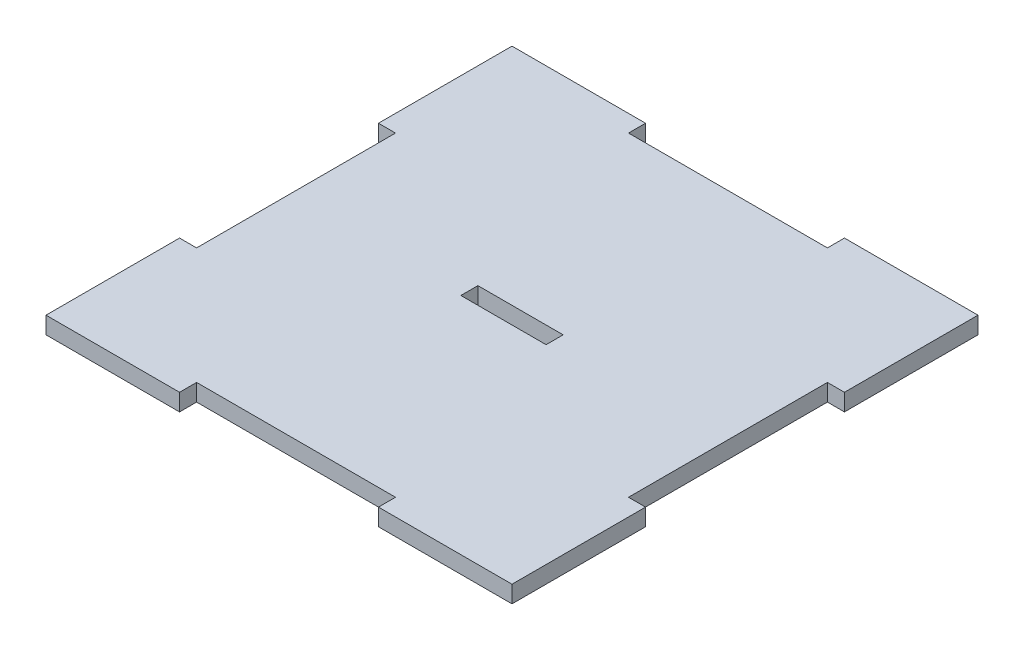
ISO-10303-21;
HEADER;
FILE_DESCRIPTION(('STEP AP214'),'2;1');
FILE_NAME('part.step','',(''),(''),'','','');
FILE_SCHEMA(('AUTOMOTIVE_DESIGN { 1 0 10303 214 1 1 1 1 }'));
ENDSEC;
DATA;
#1=APPLICATION_CONTEXT('core data for automotive mechanical design processes');
#2=APPLICATION_PROTOCOL_DEFINITION('international standard','automotive_design',2000,#1);
#3=PRODUCT_CONTEXT('',#1,'mechanical');
#4=PRODUCT('Part','Part','',(#3));
#5=PRODUCT_RELATED_PRODUCT_CATEGORY('part','',(#4));
#6=PRODUCT_DEFINITION_FORMATION('','',#4);
#7=PRODUCT_DEFINITION_CONTEXT('part definition',#1,'design');
#8=PRODUCT_DEFINITION('design','',#6,#7);
#9=PRODUCT_DEFINITION_SHAPE('','',#8);
#10=(LENGTH_UNIT() NAMED_UNIT(*) SI_UNIT(.MILLI.,.METRE.));
#11=(NAMED_UNIT(*) PLANE_ANGLE_UNIT() SI_UNIT($,.RADIAN.));
#12=(NAMED_UNIT(*) SI_UNIT($,.STERADIAN.) SOLID_ANGLE_UNIT());
#13=UNCERTAINTY_MEASURE_WITH_UNIT(LENGTH_MEASURE(1.E-05),#10,'distance_accuracy_value','');
#14=(GEOMETRIC_REPRESENTATION_CONTEXT(3) GLOBAL_UNCERTAINTY_ASSIGNED_CONTEXT((#13)) GLOBAL_UNIT_ASSIGNED_CONTEXT((#10,
#11,#12)) REPRESENTATION_CONTEXT('',''));
#15=CARTESIAN_POINT('',(0.,0.,0.));
#16=DIRECTION('',(0.,0.,1.));
#17=DIRECTION('',(1.,0.,0.));
#18=AXIS2_PLACEMENT_3D('',#15,#16,#17);
#19=CARTESIAN_POINT('',(41.,3.,-17.5));
#20=DIRECTION('',(-1.,0.,0.));
#21=DIRECTION('',(0.,0.,1.));
#22=AXIS2_PLACEMENT_3D('',#19,#20,#21);
#23=PLANE('',#22);
#24=DIRECTION('',(0.,0.,-1.));
#25=VECTOR('',#24,1.);
#26=CARTESIAN_POINT('',(41.,0.,-17.5));
#27=LINE('',#26,#25);
#28=CARTESIAN_POINT('',(41.,0.,-17.5));
#29=VERTEX_POINT('',#28);
#30=CARTESIAN_POINT('',(41.,0.,-41.));
#31=VERTEX_POINT('',#30);
#32=EDGE_CURVE('E243',#29,#31,#27,.T.);
#33=ORIENTED_EDGE('',*,*,#32,.T.);
#34=DIRECTION('',(0.,-1.,0.));
#35=VECTOR('',#34,1.);
#36=CARTESIAN_POINT('',(41.,3.,-41.));
#37=LINE('',#36,#35);
#38=CARTESIAN_POINT('',(41.,3.,-41.));
#39=VERTEX_POINT('',#38);
#40=EDGE_CURVE('E11',#39,#31,#37,.T.);
#41=ORIENTED_EDGE('',*,*,#40,.F.);
#42=DIRECTION('',(0.,0.,-1.));
#43=VECTOR('',#42,1.);
#44=CARTESIAN_POINT('',(41.,3.,-17.5));
#45=LINE('',#44,#43);
#46=CARTESIAN_POINT('',(41.,3.,-17.5));
#47=VERTEX_POINT('',#46);
#48=EDGE_CURVE('E249',#47,#39,#45,.T.);
#49=ORIENTED_EDGE('',*,*,#48,.F.);
#50=DIRECTION('',(0.,-1.,0.));
#51=VECTOR('',#50,1.);
#52=CARTESIAN_POINT('',(41.,3.,-17.5));
#53=LINE('',#52,#51);
#54=EDGE_CURVE('E311',#47,#29,#53,.T.);
#55=ORIENTED_EDGE('',*,*,#54,.T.);
#56=EDGE_LOOP('',(#33,#41,#49,#55));
#57=FACE_BOUND('',#56,.T.);
#58=ADVANCED_FACE('F39',(#57),#23,.F.);
#59=CARTESIAN_POINT('',(17.5,3.,-41.));
#60=DIRECTION('',(0.,0.,1.));
#61=DIRECTION('',(1.,0.,0.));
#62=AXIS2_PLACEMENT_3D('',#59,#60,#61);
#63=PLANE('',#62);
#64=DIRECTION('',(-1.,0.,0.));
#65=VECTOR('',#64,1.);
#66=CARTESIAN_POINT('',(17.5,0.,-41.));
#67=LINE('',#66,#65);
#68=CARTESIAN_POINT('',(17.5,0.,-41.));
#69=VERTEX_POINT('',#68);
#70=EDGE_CURVE('E315',#31,#69,#67,.T.);
#71=ORIENTED_EDGE('',*,*,#70,.T.);
#72=DIRECTION('',(0.,-1.,0.));
#73=VECTOR('',#72,1.);
#74=CARTESIAN_POINT('',(17.5,3.,-41.));
#75=LINE('',#74,#73);
#76=CARTESIAN_POINT('',(17.5,3.,-41.));
#77=VERTEX_POINT('',#76);
#78=EDGE_CURVE('E47',#77,#69,#75,.T.);
#79=ORIENTED_EDGE('',*,*,#78,.F.);
#80=DIRECTION('',(-1.,0.,0.));
#81=VECTOR('',#80,1.);
#82=CARTESIAN_POINT('',(17.5,3.,-41.));
#83=LINE('',#82,#81);
#84=EDGE_CURVE('E253',#39,#77,#83,.T.);
#85=ORIENTED_EDGE('',*,*,#84,.F.);
#86=ORIENTED_EDGE('',*,*,#40,.T.);
#87=EDGE_LOOP('',(#71,#79,#85,#86));
#88=FACE_BOUND('',#87,.T.);
#89=ADVANCED_FACE('F468',(#88),#63,.F.);
#90=CARTESIAN_POINT('',(17.5,3.,-38.));
#91=DIRECTION('',(1.,0.,0.));
#92=DIRECTION('',(0.,0.,-1.));
#93=AXIS2_PLACEMENT_3D('',#90,#91,#92);
#94=PLANE('',#93);
#95=DIRECTION('',(0.,0.,1.));
#96=VECTOR('',#95,1.);
#97=CARTESIAN_POINT('',(17.5,0.,-38.));
#98=LINE('',#97,#96);
#99=CARTESIAN_POINT('',(17.5,0.,-38.));
#100=VERTEX_POINT('',#99);
#101=EDGE_CURVE('E318',#69,#100,#98,.T.);
#102=ORIENTED_EDGE('',*,*,#101,.T.);
#103=DIRECTION('',(0.,-1.,0.));
#104=VECTOR('',#103,1.);
#105=CARTESIAN_POINT('',(17.5,3.,-38.));
#106=LINE('',#105,#104);
#107=CARTESIAN_POINT('',(17.5,3.,-38.));
#108=VERTEX_POINT('',#107);
#109=EDGE_CURVE('E438',#108,#100,#106,.T.);
#110=ORIENTED_EDGE('',*,*,#109,.F.);
#111=DIRECTION('',(0.,0.,1.));
#112=VECTOR('',#111,1.);
#113=CARTESIAN_POINT('',(17.5,3.,-38.));
#114=LINE('',#113,#112);
#115=EDGE_CURVE('E257',#77,#108,#114,.T.);
#116=ORIENTED_EDGE('',*,*,#115,.F.);
#117=ORIENTED_EDGE('',*,*,#78,.T.);
#118=EDGE_LOOP('',(#102,#110,#116,#117));
#119=FACE_BOUND('',#118,.T.);
#120=ADVANCED_FACE('F447',(#119),#94,.F.);
#121=CARTESIAN_POINT('',(-17.5,3.,-38.));
#122=DIRECTION('',(0.,0.,1.));
#123=DIRECTION('',(1.,0.,0.));
#124=AXIS2_PLACEMENT_3D('',#121,#122,#123);
#125=PLANE('',#124);
#126=DIRECTION('',(-1.,0.,0.));
#127=VECTOR('',#126,1.);
#128=CARTESIAN_POINT('',(-17.5,0.,-38.));
#129=LINE('',#128,#127);
#130=CARTESIAN_POINT('',(-17.5,0.,-38.));
#131=VERTEX_POINT('',#130);
#132=EDGE_CURVE('E321',#100,#131,#129,.T.);
#133=ORIENTED_EDGE('',*,*,#132,.T.);
#134=DIRECTION('',(0.,-1.,0.));
#135=VECTOR('',#134,1.);
#136=CARTESIAN_POINT('',(-17.5,3.,-38.));
#137=LINE('',#136,#135);
#138=CARTESIAN_POINT('',(-17.5,3.,-38.));
#139=VERTEX_POINT('',#138);
#140=EDGE_CURVE('E434',#139,#131,#137,.T.);
#141=ORIENTED_EDGE('',*,*,#140,.F.);
#142=DIRECTION('',(-1.,0.,0.));
#143=VECTOR('',#142,1.);
#144=CARTESIAN_POINT('',(-17.5,3.,-38.));
#145=LINE('',#144,#143);
#146=EDGE_CURVE('E260',#108,#139,#145,.T.);
#147=ORIENTED_EDGE('',*,*,#146,.F.);
#148=ORIENTED_EDGE('',*,*,#109,.T.);
#149=EDGE_LOOP('',(#133,#141,#147,#148));
#150=FACE_BOUND('',#149,.T.);
#151=ADVANCED_FACE('F456',(#150),#125,.F.);
#152=CARTESIAN_POINT('',(-17.5,3.,-41.));
#153=DIRECTION('',(-1.,0.,0.));
#154=DIRECTION('',(0.,0.,1.));
#155=AXIS2_PLACEMENT_3D('',#152,#153,#154);
#156=PLANE('',#155);
#157=DIRECTION('',(0.,0.,-1.));
#158=VECTOR('',#157,1.);
#159=CARTESIAN_POINT('',(-17.5,0.,-41.));
#160=LINE('',#159,#158);
#161=CARTESIAN_POINT('',(-17.5,0.,-41.));
#162=VERTEX_POINT('',#161);
#163=EDGE_CURVE('E324',#131,#162,#160,.T.);
#164=ORIENTED_EDGE('',*,*,#163,.T.);
#165=DIRECTION('',(0.,-1.,0.));
#166=VECTOR('',#165,1.);
#167=CARTESIAN_POINT('',(-17.5,3.,-41.));
#168=LINE('',#167,#166);
#169=CARTESIAN_POINT('',(-17.5,3.,-41.));
#170=VERTEX_POINT('',#169);
#171=EDGE_CURVE('E430',#170,#162,#168,.T.);
#172=ORIENTED_EDGE('',*,*,#171,.F.);
#173=DIRECTION('',(0.,0.,-1.));
#174=VECTOR('',#173,1.);
#175=CARTESIAN_POINT('',(-17.5,3.,-41.));
#176=LINE('',#175,#174);
#177=EDGE_CURVE('E263',#139,#170,#176,.T.);
#178=ORIENTED_EDGE('',*,*,#177,.F.);
#179=ORIENTED_EDGE('',*,*,#140,.T.);
#180=EDGE_LOOP('',(#164,#172,#178,#179));
#181=FACE_BOUND('',#180,.T.);
#182=ADVANCED_FACE('F460',(#181),#156,.F.);
#183=CARTESIAN_POINT('',(-41.,3.,-41.));
#184=DIRECTION('',(0.,0.,1.));
#185=DIRECTION('',(1.,0.,0.));
#186=AXIS2_PLACEMENT_3D('',#183,#184,#185);
#187=PLANE('',#186);
#188=DIRECTION('',(-1.,0.,0.));
#189=VECTOR('',#188,1.);
#190=CARTESIAN_POINT('',(-41.,0.,-41.));
#191=LINE('',#190,#189);
#192=CARTESIAN_POINT('',(-41.,0.,-41.));
#193=VERTEX_POINT('',#192);
#194=EDGE_CURVE('E327',#162,#193,#191,.T.);
#195=ORIENTED_EDGE('',*,*,#194,.T.);
#196=DIRECTION('',(0.,-1.,0.));
#197=VECTOR('',#196,1.);
#198=CARTESIAN_POINT('',(-41.,3.,-41.));
#199=LINE('',#198,#197);
#200=CARTESIAN_POINT('',(-41.,3.,-41.));
#201=VERTEX_POINT('',#200);
#202=EDGE_CURVE('E426',#201,#193,#199,.T.);
#203=ORIENTED_EDGE('',*,*,#202,.F.);
#204=DIRECTION('',(-1.,0.,0.));
#205=VECTOR('',#204,1.);
#206=CARTESIAN_POINT('',(-41.,3.,-41.));
#207=LINE('',#206,#205);
#208=EDGE_CURVE('E266',#170,#201,#207,.T.);
#209=ORIENTED_EDGE('',*,*,#208,.F.);
#210=ORIENTED_EDGE('',*,*,#171,.T.);
#211=EDGE_LOOP('',(#195,#203,#209,#210));
#212=FACE_BOUND('',#211,.T.);
#213=ADVANCED_FACE('F541',(#212),#187,.F.);
#214=CARTESIAN_POINT('',(-41.,3.,-17.5));
#215=DIRECTION('',(1.,0.,0.));
#216=DIRECTION('',(0.,0.,-1.));
#217=AXIS2_PLACEMENT_3D('',#214,#215,#216);
#218=PLANE('',#217);
#219=DIRECTION('',(0.,0.,1.));
#220=VECTOR('',#219,1.);
#221=CARTESIAN_POINT('',(-41.,0.,-17.5));
#222=LINE('',#221,#220);
#223=CARTESIAN_POINT('',(-41.,0.,-17.5));
#224=VERTEX_POINT('',#223);
#225=EDGE_CURVE('E330',#193,#224,#222,.T.);
#226=ORIENTED_EDGE('',*,*,#225,.T.);
#227=DIRECTION('',(0.,-1.,0.));
#228=VECTOR('',#227,1.);
#229=CARTESIAN_POINT('',(-41.,3.,-17.5));
#230=LINE('',#229,#228);
#231=CARTESIAN_POINT('',(-41.,3.,-17.5));
#232=VERTEX_POINT('',#231);
#233=EDGE_CURVE('E422',#232,#224,#230,.T.);
#234=ORIENTED_EDGE('',*,*,#233,.F.);
#235=DIRECTION('',(0.,0.,1.));
#236=VECTOR('',#235,1.);
#237=CARTESIAN_POINT('',(-41.,3.,-17.5));
#238=LINE('',#237,#236);
#239=EDGE_CURVE('E269',#201,#232,#238,.T.);
#240=ORIENTED_EDGE('',*,*,#239,.F.);
#241=ORIENTED_EDGE('',*,*,#202,.T.);
#242=EDGE_LOOP('',(#226,#234,#240,#241));
#243=FACE_BOUND('',#242,.T.);
#244=ADVANCED_FACE('F539',(#243),#218,.F.);
#245=CARTESIAN_POINT('',(-41.,3.,-17.5));
#246=DIRECTION('',(0.,0.,-1.));
#247=DIRECTION('',(-1.,0.,0.));
#248=AXIS2_PLACEMENT_3D('',#245,#246,#247);
#249=PLANE('',#248);
#250=DIRECTION('',(1.,0.,0.));
#251=VECTOR('',#250,1.);
#252=CARTESIAN_POINT('',(-41.,0.,-17.5));
#253=LINE('',#252,#251);
#254=CARTESIAN_POINT('',(-38.,0.,-17.5));
#255=VERTEX_POINT('',#254);
#256=EDGE_CURVE('E333',#224,#255,#253,.T.);
#257=ORIENTED_EDGE('',*,*,#256,.T.);
#258=DIRECTION('',(0.,-1.,0.));
#259=VECTOR('',#258,1.);
#260=CARTESIAN_POINT('',(-38.,3.,-17.5));
#261=LINE('',#260,#259);
#262=CARTESIAN_POINT('',(-38.,3.,-17.5));
#263=VERTEX_POINT('',#262);
#264=EDGE_CURVE('E418',#263,#255,#261,.T.);
#265=ORIENTED_EDGE('',*,*,#264,.F.);
#266=DIRECTION('',(1.,0.,0.));
#267=VECTOR('',#266,1.);
#268=CARTESIAN_POINT('',(-41.,3.,-17.5));
#269=LINE('',#268,#267);
#270=EDGE_CURVE('E272',#232,#263,#269,.T.);
#271=ORIENTED_EDGE('',*,*,#270,.F.);
#272=ORIENTED_EDGE('',*,*,#233,.T.);
#273=EDGE_LOOP('',(#257,#265,#271,#272));
#274=FACE_BOUND('',#273,.T.);
#275=ADVANCED_FACE('F534',(#274),#249,.F.);
#276=CARTESIAN_POINT('',(-38.,3.,-17.5));
#277=DIRECTION('',(1.,0.,0.));
#278=DIRECTION('',(0.,0.,-1.));
#279=AXIS2_PLACEMENT_3D('',#276,#277,#278);
#280=PLANE('',#279);
#281=DIRECTION('',(0.,0.,1.));
#282=VECTOR('',#281,1.);
#283=CARTESIAN_POINT('',(-38.,0.,-17.5));
#284=LINE('',#283,#282);
#285=CARTESIAN_POINT('',(-38.,0.,17.5));
#286=VERTEX_POINT('',#285);
#287=EDGE_CURVE('E336',#255,#286,#284,.T.);
#288=ORIENTED_EDGE('',*,*,#287,.T.);
#289=DIRECTION('',(0.,-1.,0.));
#290=VECTOR('',#289,1.);
#291=CARTESIAN_POINT('',(-38.,3.,17.5));
#292=LINE('',#291,#290);
#293=CARTESIAN_POINT('',(-38.,3.,17.5));
#294=VERTEX_POINT('',#293);
#295=EDGE_CURVE('E414',#294,#286,#292,.T.);
#296=ORIENTED_EDGE('',*,*,#295,.F.);
#297=DIRECTION('',(0.,0.,1.));
#298=VECTOR('',#297,1.);
#299=CARTESIAN_POINT('',(-38.,3.,-17.5));
#300=LINE('',#299,#298);
#301=EDGE_CURVE('E275',#263,#294,#300,.T.);
#302=ORIENTED_EDGE('',*,*,#301,.F.);
#303=ORIENTED_EDGE('',*,*,#264,.T.);
#304=EDGE_LOOP('',(#288,#296,#302,#303));
#305=FACE_BOUND('',#304,.T.);
#306=ADVANCED_FACE('F529',(#305),#280,.F.);
#307=CARTESIAN_POINT('',(-38.,3.,17.5));
#308=DIRECTION('',(0.,0.,1.));
#309=DIRECTION('',(1.,0.,0.));
#310=AXIS2_PLACEMENT_3D('',#307,#308,#309);
#311=PLANE('',#310);
#312=DIRECTION('',(-1.,0.,0.));
#313=VECTOR('',#312,1.);
#314=CARTESIAN_POINT('',(-38.,0.,17.5));
#315=LINE('',#314,#313);
#316=CARTESIAN_POINT('',(-41.,0.,17.5));
#317=VERTEX_POINT('',#316);
#318=EDGE_CURVE('E339',#286,#317,#315,.T.);
#319=ORIENTED_EDGE('',*,*,#318,.T.);
#320=DIRECTION('',(0.,-1.,0.));
#321=VECTOR('',#320,1.);
#322=CARTESIAN_POINT('',(-41.,3.,17.5));
#323=LINE('',#322,#321);
#324=CARTESIAN_POINT('',(-41.,3.,17.5));
#325=VERTEX_POINT('',#324);
#326=EDGE_CURVE('E410',#325,#317,#323,.T.);
#327=ORIENTED_EDGE('',*,*,#326,.F.);
#328=DIRECTION('',(-1.,0.,0.));
#329=VECTOR('',#328,1.);
#330=CARTESIAN_POINT('',(-38.,3.,17.5));
#331=LINE('',#330,#329);
#332=EDGE_CURVE('E278',#294,#325,#331,.T.);
#333=ORIENTED_EDGE('',*,*,#332,.F.);
#334=ORIENTED_EDGE('',*,*,#295,.T.);
#335=EDGE_LOOP('',(#319,#327,#333,#334));
#336=FACE_BOUND('',#335,.T.);
#337=ADVANCED_FACE('F525',(#336),#311,.F.);
#338=CARTESIAN_POINT('',(-41.,3.,41.));
#339=DIRECTION('',(1.,0.,0.));
#340=DIRECTION('',(0.,0.,-1.));
#341=AXIS2_PLACEMENT_3D('',#338,#339,#340);
#342=PLANE('',#341);
#343=DIRECTION('',(0.,0.,1.));
#344=VECTOR('',#343,1.);
#345=CARTESIAN_POINT('',(-41.,0.,41.));
#346=LINE('',#345,#344);
#347=CARTESIAN_POINT('',(-41.,0.,41.));
#348=VERTEX_POINT('',#347);
#349=EDGE_CURVE('E342',#317,#348,#346,.T.);
#350=ORIENTED_EDGE('',*,*,#349,.T.);
#351=DIRECTION('',(0.,-1.,0.));
#352=VECTOR('',#351,1.);
#353=CARTESIAN_POINT('',(-41.,3.,41.));
#354=LINE('',#353,#352);
#355=CARTESIAN_POINT('',(-41.,3.,41.));
#356=VERTEX_POINT('',#355);
#357=EDGE_CURVE('E406',#356,#348,#354,.T.);
#358=ORIENTED_EDGE('',*,*,#357,.F.);
#359=DIRECTION('',(0.,0.,1.));
#360=VECTOR('',#359,1.);
#361=CARTESIAN_POINT('',(-41.,3.,41.));
#362=LINE('',#361,#360);
#363=EDGE_CURVE('E281',#325,#356,#362,.T.);
#364=ORIENTED_EDGE('',*,*,#363,.F.);
#365=ORIENTED_EDGE('',*,*,#326,.T.);
#366=EDGE_LOOP('',(#350,#358,#364,#365));
#367=FACE_BOUND('',#366,.T.);
#368=ADVANCED_FACE('F520',(#367),#342,.F.);
#369=CARTESIAN_POINT('',(-41.,3.,41.));
#370=DIRECTION('',(0.,0.,-1.));
#371=DIRECTION('',(-1.,0.,0.));
#372=AXIS2_PLACEMENT_3D('',#369,#370,#371);
#373=PLANE('',#372);
#374=DIRECTION('',(1.,0.,0.));
#375=VECTOR('',#374,1.);
#376=CARTESIAN_POINT('',(-41.,0.,41.));
#377=LINE('',#376,#375);
#378=CARTESIAN_POINT('',(-17.5,0.,41.));
#379=VERTEX_POINT('',#378);
#380=EDGE_CURVE('E345',#348,#379,#377,.T.);
#381=ORIENTED_EDGE('',*,*,#380,.T.);
#382=DIRECTION('',(0.,-1.,0.));
#383=VECTOR('',#382,1.);
#384=CARTESIAN_POINT('',(-17.5,3.,41.));
#385=LINE('',#384,#383);
#386=CARTESIAN_POINT('',(-17.5,3.,41.));
#387=VERTEX_POINT('',#386);
#388=EDGE_CURVE('E402',#387,#379,#385,.T.);
#389=ORIENTED_EDGE('',*,*,#388,.F.);
#390=DIRECTION('',(1.,0.,0.));
#391=VECTOR('',#390,1.);
#392=CARTESIAN_POINT('',(-41.,3.,41.));
#393=LINE('',#392,#391);
#394=EDGE_CURVE('E284',#356,#387,#393,.T.);
#395=ORIENTED_EDGE('',*,*,#394,.F.);
#396=ORIENTED_EDGE('',*,*,#357,.T.);
#397=EDGE_LOOP('',(#381,#389,#395,#396));
#398=FACE_BOUND('',#397,.T.);
#399=ADVANCED_FACE('F514',(#398),#373,.F.);
#400=CARTESIAN_POINT('',(-17.5,3.,38.));
#401=DIRECTION('',(-1.,0.,0.));
#402=DIRECTION('',(0.,0.,1.));
#403=AXIS2_PLACEMENT_3D('',#400,#401,#402);
#404=PLANE('',#403);
#405=DIRECTION('',(0.,0.,-1.));
#406=VECTOR('',#405,1.);
#407=CARTESIAN_POINT('',(-17.5,0.,38.));
#408=LINE('',#407,#406);
#409=CARTESIAN_POINT('',(-17.5,0.,38.));
#410=VERTEX_POINT('',#409);
#411=EDGE_CURVE('E348',#379,#410,#408,.T.);
#412=ORIENTED_EDGE('',*,*,#411,.T.);
#413=DIRECTION('',(0.,-1.,0.));
#414=VECTOR('',#413,1.);
#415=CARTESIAN_POINT('',(-17.5,3.,38.));
#416=LINE('',#415,#414);
#417=CARTESIAN_POINT('',(-17.5,3.,38.));
#418=VERTEX_POINT('',#417);
#419=EDGE_CURVE('E398',#418,#410,#416,.T.);
#420=ORIENTED_EDGE('',*,*,#419,.F.);
#421=DIRECTION('',(0.,0.,-1.));
#422=VECTOR('',#421,1.);
#423=CARTESIAN_POINT('',(-17.5,3.,38.));
#424=LINE('',#423,#422);
#425=EDGE_CURVE('E287',#387,#418,#424,.T.);
#426=ORIENTED_EDGE('',*,*,#425,.F.);
#427=ORIENTED_EDGE('',*,*,#388,.T.);
#428=EDGE_LOOP('',(#412,#420,#426,#427));
#429=FACE_BOUND('',#428,.T.);
#430=ADVANCED_FACE('F510',(#429),#404,.F.);
#431=CARTESIAN_POINT('',(17.5,3.,38.));
#432=DIRECTION('',(0.,0.,-1.));
#433=DIRECTION('',(-1.,0.,0.));
#434=AXIS2_PLACEMENT_3D('',#431,#432,#433);
#435=PLANE('',#434);
#436=DIRECTION('',(1.,0.,0.));
#437=VECTOR('',#436,1.);
#438=CARTESIAN_POINT('',(17.5,0.,38.));
#439=LINE('',#438,#437);
#440=CARTESIAN_POINT('',(17.5,0.,38.));
#441=VERTEX_POINT('',#440);
#442=EDGE_CURVE('E351',#410,#441,#439,.T.);
#443=ORIENTED_EDGE('',*,*,#442,.T.);
#444=DIRECTION('',(0.,-1.,0.));
#445=VECTOR('',#444,1.);
#446=CARTESIAN_POINT('',(17.5,3.,38.));
#447=LINE('',#446,#445);
#448=CARTESIAN_POINT('',(17.5,3.,38.));
#449=VERTEX_POINT('',#448);
#450=EDGE_CURVE('E394',#449,#441,#447,.T.);
#451=ORIENTED_EDGE('',*,*,#450,.F.);
#452=DIRECTION('',(1.,0.,0.));
#453=VECTOR('',#452,1.);
#454=CARTESIAN_POINT('',(17.5,3.,38.));
#455=LINE('',#454,#453);
#456=EDGE_CURVE('E290',#418,#449,#455,.T.);
#457=ORIENTED_EDGE('',*,*,#456,.F.);
#458=ORIENTED_EDGE('',*,*,#419,.T.);
#459=EDGE_LOOP('',(#443,#451,#457,#458));
#460=FACE_BOUND('',#459,.T.);
#461=ADVANCED_FACE('F505',(#460),#435,.F.);
#462=CARTESIAN_POINT('',(17.5,3.,41.));
#463=DIRECTION('',(1.,0.,0.));
#464=DIRECTION('',(0.,0.,-1.));
#465=AXIS2_PLACEMENT_3D('',#462,#463,#464);
#466=PLANE('',#465);
#467=DIRECTION('',(0.,0.,1.));
#468=VECTOR('',#467,1.);
#469=CARTESIAN_POINT('',(17.5,0.,41.));
#470=LINE('',#469,#468);
#471=CARTESIAN_POINT('',(17.5,0.,41.));
#472=VERTEX_POINT('',#471);
#473=EDGE_CURVE('E354',#441,#472,#470,.T.);
#474=ORIENTED_EDGE('',*,*,#473,.T.);
#475=DIRECTION('',(0.,-1.,0.));
#476=VECTOR('',#475,1.);
#477=CARTESIAN_POINT('',(17.5,3.,41.));
#478=LINE('',#477,#476);
#479=CARTESIAN_POINT('',(17.5,3.,41.));
#480=VERTEX_POINT('',#479);
#481=EDGE_CURVE('E390',#480,#472,#478,.T.);
#482=ORIENTED_EDGE('',*,*,#481,.F.);
#483=DIRECTION('',(0.,0.,1.));
#484=VECTOR('',#483,1.);
#485=CARTESIAN_POINT('',(17.5,3.,41.));
#486=LINE('',#485,#484);
#487=EDGE_CURVE('E293',#449,#480,#486,.T.);
#488=ORIENTED_EDGE('',*,*,#487,.F.);
#489=ORIENTED_EDGE('',*,*,#450,.T.);
#490=EDGE_LOOP('',(#474,#482,#488,#489));
#491=FACE_BOUND('',#490,.T.);
#492=ADVANCED_FACE('F499',(#491),#466,.F.);
#493=CARTESIAN_POINT('',(17.5,3.,41.));
#494=DIRECTION('',(0.,0.,-1.));
#495=DIRECTION('',(-1.,0.,0.));
#496=AXIS2_PLACEMENT_3D('',#493,#494,#495);
#497=PLANE('',#496);
#498=DIRECTION('',(1.,0.,0.));
#499=VECTOR('',#498,1.);
#500=CARTESIAN_POINT('',(17.5,0.,41.));
#501=LINE('',#500,#499);
#502=CARTESIAN_POINT('',(41.,0.,41.));
#503=VERTEX_POINT('',#502);
#504=EDGE_CURVE('E357',#472,#503,#501,.T.);
#505=ORIENTED_EDGE('',*,*,#504,.T.);
#506=DIRECTION('',(0.,-1.,0.));
#507=VECTOR('',#506,1.);
#508=CARTESIAN_POINT('',(41.,3.,41.));
#509=LINE('',#508,#507);
#510=CARTESIAN_POINT('',(41.,3.,41.));
#511=VERTEX_POINT('',#510);
#512=EDGE_CURVE('E386',#511,#503,#509,.T.);
#513=ORIENTED_EDGE('',*,*,#512,.F.);
#514=DIRECTION('',(1.,0.,0.));
#515=VECTOR('',#514,1.);
#516=CARTESIAN_POINT('',(17.5,3.,41.));
#517=LINE('',#516,#515);
#518=EDGE_CURVE('E296',#480,#511,#517,.T.);
#519=ORIENTED_EDGE('',*,*,#518,.F.);
#520=ORIENTED_EDGE('',*,*,#481,.T.);
#521=EDGE_LOOP('',(#505,#513,#519,#520));
#522=FACE_BOUND('',#521,.T.);
#523=ADVANCED_FACE('F495',(#522),#497,.F.);
#524=CARTESIAN_POINT('',(41.,3.,41.));
#525=DIRECTION('',(-1.,0.,0.));
#526=DIRECTION('',(0.,0.,1.));
#527=AXIS2_PLACEMENT_3D('',#524,#525,#526);
#528=PLANE('',#527);
#529=DIRECTION('',(0.,0.,-1.));
#530=VECTOR('',#529,1.);
#531=CARTESIAN_POINT('',(41.,0.,41.));
#532=LINE('',#531,#530);
#533=CARTESIAN_POINT('',(41.,0.,17.5));
#534=VERTEX_POINT('',#533);
#535=EDGE_CURVE('E360',#503,#534,#532,.T.);
#536=ORIENTED_EDGE('',*,*,#535,.T.);
#537=DIRECTION('',(0.,-1.,0.));
#538=VECTOR('',#537,1.);
#539=CARTESIAN_POINT('',(41.,3.,17.5));
#540=LINE('',#539,#538);
#541=CARTESIAN_POINT('',(41.,3.,17.5));
#542=VERTEX_POINT('',#541);
#543=EDGE_CURVE('E382',#542,#534,#540,.T.);
#544=ORIENTED_EDGE('',*,*,#543,.F.);
#545=DIRECTION('',(0.,0.,-1.));
#546=VECTOR('',#545,1.);
#547=CARTESIAN_POINT('',(41.,3.,41.));
#548=LINE('',#547,#546);
#549=EDGE_CURVE('E299',#511,#542,#548,.T.);
#550=ORIENTED_EDGE('',*,*,#549,.F.);
#551=ORIENTED_EDGE('',*,*,#512,.T.);
#552=EDGE_LOOP('',(#536,#544,#550,#551));
#553=FACE_BOUND('',#552,.T.);
#554=ADVANCED_FACE('F490',(#553),#528,.F.);
#555=CARTESIAN_POINT('',(38.,3.,17.5));
#556=DIRECTION('',(0.,0.,1.));
#557=DIRECTION('',(1.,0.,0.));
#558=AXIS2_PLACEMENT_3D('',#555,#556,#557);
#559=PLANE('',#558);
#560=DIRECTION('',(-1.,0.,0.));
#561=VECTOR('',#560,1.);
#562=CARTESIAN_POINT('',(38.,0.,17.5));
#563=LINE('',#562,#561);
#564=CARTESIAN_POINT('',(38.,0.,17.5));
#565=VERTEX_POINT('',#564);
#566=EDGE_CURVE('E363',#534,#565,#563,.T.);
#567=ORIENTED_EDGE('',*,*,#566,.T.);
#568=DIRECTION('',(0.,-1.,0.));
#569=VECTOR('',#568,1.);
#570=CARTESIAN_POINT('',(38.,3.,17.5));
#571=LINE('',#570,#569);
#572=CARTESIAN_POINT('',(38.,3.,17.5));
#573=VERTEX_POINT('',#572);
#574=EDGE_CURVE('E378',#573,#565,#571,.T.);
#575=ORIENTED_EDGE('',*,*,#574,.F.);
#576=DIRECTION('',(-1.,0.,0.));
#577=VECTOR('',#576,1.);
#578=CARTESIAN_POINT('',(38.,3.,17.5));
#579=LINE('',#578,#577);
#580=EDGE_CURVE('E302',#542,#573,#579,.T.);
#581=ORIENTED_EDGE('',*,*,#580,.F.);
#582=ORIENTED_EDGE('',*,*,#543,.T.);
#583=EDGE_LOOP('',(#567,#575,#581,#582));
#584=FACE_BOUND('',#583,.T.);
#585=ADVANCED_FACE('F484',(#584),#559,.F.);
#586=CARTESIAN_POINT('',(38.,3.,-17.5));
#587=DIRECTION('',(-1.,0.,0.));
#588=DIRECTION('',(0.,0.,1.));
#589=AXIS2_PLACEMENT_3D('',#586,#587,#588);
#590=PLANE('',#589);
#591=DIRECTION('',(0.,0.,-1.));
#592=VECTOR('',#591,1.);
#593=CARTESIAN_POINT('',(38.,0.,-17.5));
#594=LINE('',#593,#592);
#595=CARTESIAN_POINT('',(38.,0.,-17.5));
#596=VERTEX_POINT('',#595);
#597=EDGE_CURVE('E366',#565,#596,#594,.T.);
#598=ORIENTED_EDGE('',*,*,#597,.T.);
#599=DIRECTION('',(0.,-1.,0.));
#600=VECTOR('',#599,1.);
#601=CARTESIAN_POINT('',(38.,3.,-17.5));
#602=LINE('',#601,#600);
#603=CARTESIAN_POINT('',(38.,3.,-17.5));
#604=VERTEX_POINT('',#603);
#605=EDGE_CURVE('E374',#604,#596,#602,.T.);
#606=ORIENTED_EDGE('',*,*,#605,.F.);
#607=DIRECTION('',(0.,0.,-1.));
#608=VECTOR('',#607,1.);
#609=CARTESIAN_POINT('',(38.,3.,-17.5));
#610=LINE('',#609,#608);
#611=EDGE_CURVE('E305',#573,#604,#610,.T.);
#612=ORIENTED_EDGE('',*,*,#611,.F.);
#613=ORIENTED_EDGE('',*,*,#574,.T.);
#614=EDGE_LOOP('',(#598,#606,#612,#613));
#615=FACE_BOUND('',#614,.T.);
#616=ADVANCED_FACE('F480',(#615),#590,.F.);
#617=CARTESIAN_POINT('',(41.,3.,-17.5));
#618=DIRECTION('',(0.,0.,-1.));
#619=DIRECTION('',(-1.,0.,0.));
#620=AXIS2_PLACEMENT_3D('',#617,#618,#619);
#621=PLANE('',#620);
#622=DIRECTION('',(1.,0.,0.));
#623=VECTOR('',#622,1.);
#624=CARTESIAN_POINT('',(41.,0.,-17.5));
#625=LINE('',#624,#623);
#626=EDGE_CURVE('E254',#596,#29,#625,.T.);
#627=ORIENTED_EDGE('',*,*,#626,.T.);
#628=ORIENTED_EDGE('',*,*,#54,.F.);
#629=DIRECTION('',(1.,0.,0.));
#630=VECTOR('',#629,1.);
#631=CARTESIAN_POINT('',(41.,3.,-17.5));
#632=LINE('',#631,#630);
#633=EDGE_CURVE('E308',#604,#47,#632,.T.);
#634=ORIENTED_EDGE('',*,*,#633,.F.);
#635=ORIENTED_EDGE('',*,*,#605,.T.);
#636=EDGE_LOOP('',(#627,#628,#634,#635));
#637=FACE_BOUND('',#636,.T.);
#638=ADVANCED_FACE('F475',(#637),#621,.F.);
#639=CARTESIAN_POINT('',(0.,3.,0.));
#640=DIRECTION('',(0.,-1.,0.));
#641=DIRECTION('',(0.,0.,-1.));
#642=AXIS2_PLACEMENT_3D('',#639,#640,#641);
#643=PLANE('',#642);
#644=DIRECTION('',(-1.,0.,0.));
#645=VECTOR('',#644,1.);
#646=CARTESIAN_POINT('',(-7.5,3.,-1.5));
#647=LINE('',#646,#645);
#648=CARTESIAN_POINT('',(7.5,3.,-1.5));
#649=VERTEX_POINT('',#648);
#650=CARTESIAN_POINT('',(-7.5,3.,-1.5));
#651=VERTEX_POINT('',#650);
#652=EDGE_CURVE('E234',#649,#651,#647,.T.);
#653=ORIENTED_EDGE('',*,*,#652,.F.);
#654=DIRECTION('',(0.,0.,-1.));
#655=VECTOR('',#654,1.);
#656=CARTESIAN_POINT('',(7.5,3.,-1.5));
#657=LINE('',#656,#655);
#658=CARTESIAN_POINT('',(7.5,3.,1.5));
#659=VERTEX_POINT('',#658);
#660=EDGE_CURVE('E54',#659,#649,#657,.T.);
#661=ORIENTED_EDGE('',*,*,#660,.F.);
#662=DIRECTION('',(1.,0.,0.));
#663=VECTOR('',#662,1.);
#664=CARTESIAN_POINT('',(-7.5,3.,1.5));
#665=LINE('',#664,#663);
#666=CARTESIAN_POINT('',(-7.5,3.,1.5));
#667=VERTEX_POINT('',#666);
#668=EDGE_CURVE('E221',#667,#659,#665,.T.);
#669=ORIENTED_EDGE('',*,*,#668,.F.);
#670=DIRECTION('',(0.,0.,1.));
#671=VECTOR('',#670,1.);
#672=CARTESIAN_POINT('',(-7.5,3.,-1.5));
#673=LINE('',#672,#671);
#674=EDGE_CURVE('E225',#651,#667,#673,.T.);
#675=ORIENTED_EDGE('',*,*,#674,.F.);
#676=EDGE_LOOP('',(#653,#661,#669,#675));
#677=FACE_BOUND('',#676,.T.);
#678=ORIENTED_EDGE('',*,*,#48,.T.);
#679=ORIENTED_EDGE('',*,*,#84,.T.);
#680=ORIENTED_EDGE('',*,*,#115,.T.);
#681=ORIENTED_EDGE('',*,*,#146,.T.);
#682=ORIENTED_EDGE('',*,*,#177,.T.);
#683=ORIENTED_EDGE('',*,*,#208,.T.);
#684=ORIENTED_EDGE('',*,*,#239,.T.);
#685=ORIENTED_EDGE('',*,*,#270,.T.);
#686=ORIENTED_EDGE('',*,*,#301,.T.);
#687=ORIENTED_EDGE('',*,*,#332,.T.);
#688=ORIENTED_EDGE('',*,*,#363,.T.);
#689=ORIENTED_EDGE('',*,*,#394,.T.);
#690=ORIENTED_EDGE('',*,*,#425,.T.);
#691=ORIENTED_EDGE('',*,*,#456,.T.);
#692=ORIENTED_EDGE('',*,*,#487,.T.);
#693=ORIENTED_EDGE('',*,*,#518,.T.);
#694=ORIENTED_EDGE('',*,*,#549,.T.);
#695=ORIENTED_EDGE('',*,*,#580,.T.);
#696=ORIENTED_EDGE('',*,*,#611,.T.);
#697=ORIENTED_EDGE('',*,*,#633,.T.);
#698=EDGE_LOOP('',(#678,#679,#680,#681,#682,#683,#684,#685,#686,#687,#688,#689,#690,#691,#692,
#693,#694,#695,#696,#697));
#699=FACE_BOUND('',#698,.T.);
#700=ADVANCED_FACE('F464',(#677,#699),#643,.F.);
#701=CARTESIAN_POINT('',(0.,0.,0.));
#702=DIRECTION('',(0.,-1.,0.));
#703=DIRECTION('',(0.,0.,-1.));
#704=AXIS2_PLACEMENT_3D('',#701,#702,#703);
#705=PLANE('',#704);
#706=DIRECTION('',(0.,0.,-1.));
#707=VECTOR('',#706,1.);
#708=CARTESIAN_POINT('',(7.5,0.,-1.5));
#709=LINE('',#708,#707);
#710=CARTESIAN_POINT('',(7.5,0.,1.5));
#711=VERTEX_POINT('',#710);
#712=CARTESIAN_POINT('',(7.5,0.,-1.5));
#713=VERTEX_POINT('',#712);
#714=EDGE_CURVE('E202',#711,#713,#709,.T.);
#715=ORIENTED_EDGE('',*,*,#714,.T.);
#716=DIRECTION('',(-1.,0.,0.));
#717=VECTOR('',#716,1.);
#718=CARTESIAN_POINT('',(-7.5,0.,-1.5));
#719=LINE('',#718,#717);
#720=CARTESIAN_POINT('',(-7.5,0.,-1.5));
#721=VERTEX_POINT('',#720);
#722=EDGE_CURVE('E212',#713,#721,#719,.T.);
#723=ORIENTED_EDGE('',*,*,#722,.T.);
#724=DIRECTION('',(0.,0.,1.));
#725=VECTOR('',#724,1.);
#726=CARTESIAN_POINT('',(-7.5,0.,-1.5));
#727=LINE('',#726,#725);
#728=CARTESIAN_POINT('',(-7.5,0.,1.5));
#729=VERTEX_POINT('',#728);
#730=EDGE_CURVE('E62',#721,#729,#727,.T.);
#731=ORIENTED_EDGE('',*,*,#730,.T.);
#732=DIRECTION('',(1.,0.,0.));
#733=VECTOR('',#732,1.);
#734=CARTESIAN_POINT('',(-7.5,0.,1.5));
#735=LINE('',#734,#733);
#736=EDGE_CURVE('E209',#729,#711,#735,.T.);
#737=ORIENTED_EDGE('',*,*,#736,.T.);
#738=EDGE_LOOP('',(#715,#723,#731,#737));
#739=FACE_BOUND('',#738,.T.);
#740=ORIENTED_EDGE('',*,*,#32,.F.);
#741=ORIENTED_EDGE('',*,*,#626,.F.);
#742=ORIENTED_EDGE('',*,*,#597,.F.);
#743=ORIENTED_EDGE('',*,*,#566,.F.);
#744=ORIENTED_EDGE('',*,*,#535,.F.);
#745=ORIENTED_EDGE('',*,*,#504,.F.);
#746=ORIENTED_EDGE('',*,*,#473,.F.);
#747=ORIENTED_EDGE('',*,*,#442,.F.);
#748=ORIENTED_EDGE('',*,*,#411,.F.);
#749=ORIENTED_EDGE('',*,*,#380,.F.);
#750=ORIENTED_EDGE('',*,*,#349,.F.);
#751=ORIENTED_EDGE('',*,*,#318,.F.);
#752=ORIENTED_EDGE('',*,*,#287,.F.);
#753=ORIENTED_EDGE('',*,*,#256,.F.);
#754=ORIENTED_EDGE('',*,*,#225,.F.);
#755=ORIENTED_EDGE('',*,*,#194,.F.);
#756=ORIENTED_EDGE('',*,*,#163,.F.);
#757=ORIENTED_EDGE('',*,*,#132,.F.);
#758=ORIENTED_EDGE('',*,*,#101,.F.);
#759=ORIENTED_EDGE('',*,*,#70,.F.);
#760=EDGE_LOOP('',(#740,#741,#742,#743,#744,#745,#746,#747,#748,#749,#750,#751,#752,#753,#754,
#755,#756,#757,#758,#759));
#761=FACE_BOUND('',#760,.T.);
#762=ADVANCED_FACE('F217',(#739,#761),#705,.T.);
#763=CARTESIAN_POINT('',(7.5,0.,-1.5));
#764=DIRECTION('',(1.,0.,0.));
#765=DIRECTION('',(0.,0.,-1.));
#766=AXIS2_PLACEMENT_3D('',#763,#764,#765);
#767=PLANE('',#766);
#768=ORIENTED_EDGE('',*,*,#660,.T.);
#769=DIRECTION('',(0.,1.,0.));
#770=VECTOR('',#769,1.);
#771=CARTESIAN_POINT('',(7.5,0.,-1.5));
#772=LINE('',#771,#770);
#773=EDGE_CURVE('E198',#713,#649,#772,.T.);
#774=ORIENTED_EDGE('',*,*,#773,.F.);
#775=ORIENTED_EDGE('',*,*,#714,.F.);
#776=DIRECTION('',(0.,1.,0.));
#777=VECTOR('',#776,1.);
#778=CARTESIAN_POINT('',(7.5,0.,1.5));
#779=LINE('',#778,#777);
#780=EDGE_CURVE('E240',#711,#659,#779,.T.);
#781=ORIENTED_EDGE('',*,*,#780,.T.);
#782=EDGE_LOOP('',(#768,#774,#775,#781));
#783=FACE_BOUND('',#782,.T.);
#784=ADVANCED_FACE('F200',(#783),#767,.F.);
#785=CARTESIAN_POINT('',(-7.5,0.,1.5));
#786=DIRECTION('',(0.,0.,1.));
#787=DIRECTION('',(1.,0.,0.));
#788=AXIS2_PLACEMENT_3D('',#785,#786,#787);
#789=PLANE('',#788);
#790=ORIENTED_EDGE('',*,*,#668,.T.);
#791=ORIENTED_EDGE('',*,*,#780,.F.);
#792=ORIENTED_EDGE('',*,*,#736,.F.);
#793=DIRECTION('',(0.,1.,0.));
#794=VECTOR('',#793,1.);
#795=CARTESIAN_POINT('',(-7.5,0.,1.5));
#796=LINE('',#795,#794);
#797=EDGE_CURVE('E244',#729,#667,#796,.T.);
#798=ORIENTED_EDGE('',*,*,#797,.T.);
#799=EDGE_LOOP('',(#790,#791,#792,#798));
#800=FACE_BOUND('',#799,.T.);
#801=ADVANCED_FACE('F708',(#800),#789,.F.);
#802=CARTESIAN_POINT('',(-7.5,0.,-1.5));
#803=DIRECTION('',(-1.,0.,0.));
#804=DIRECTION('',(0.,0.,1.));
#805=AXIS2_PLACEMENT_3D('',#802,#803,#804);
#806=PLANE('',#805);
#807=ORIENTED_EDGE('',*,*,#674,.T.);
#808=ORIENTED_EDGE('',*,*,#797,.F.);
#809=ORIENTED_EDGE('',*,*,#730,.F.);
#810=DIRECTION('',(0.,1.,0.));
#811=VECTOR('',#810,1.);
#812=CARTESIAN_POINT('',(-7.5,0.,-1.5));
#813=LINE('',#812,#811);
#814=EDGE_CURVE('E208',#721,#651,#813,.T.);
#815=ORIENTED_EDGE('',*,*,#814,.T.);
#816=EDGE_LOOP('',(#807,#808,#809,#815));
#817=FACE_BOUND('',#816,.T.);
#818=ADVANCED_FACE('F717',(#817),#806,.F.);
#819=CARTESIAN_POINT('',(-7.5,0.,-1.5));
#820=DIRECTION('',(0.,0.,-1.));
#821=DIRECTION('',(-1.,0.,0.));
#822=AXIS2_PLACEMENT_3D('',#819,#820,#821);
#823=PLANE('',#822);
#824=ORIENTED_EDGE('',*,*,#652,.T.);
#825=ORIENTED_EDGE('',*,*,#814,.F.);
#826=ORIENTED_EDGE('',*,*,#722,.F.);
#827=ORIENTED_EDGE('',*,*,#773,.T.);
#828=EDGE_LOOP('',(#824,#825,#826,#827));
#829=FACE_BOUND('',#828,.T.);
#830=ADVANCED_FACE('F213',(#829),#823,.F.);
#831=CLOSED_SHELL('',(#58,#89,#120,#151,#182,#213,#244,#275,#306,#337,#368,#399,#430,#461,#492,
#523,#554,#585,#616,#638,#700,#762,#784,#801,#818,#830));
#832=MANIFOLD_SOLID_BREP('B2',#831);
#833=ADVANCED_BREP_SHAPE_REPRESENTATION('',(#18,#832),#14);
#834=SHAPE_DEFINITION_REPRESENTATION(#9,#833);
ENDSEC;
END-ISO-10303-21;
